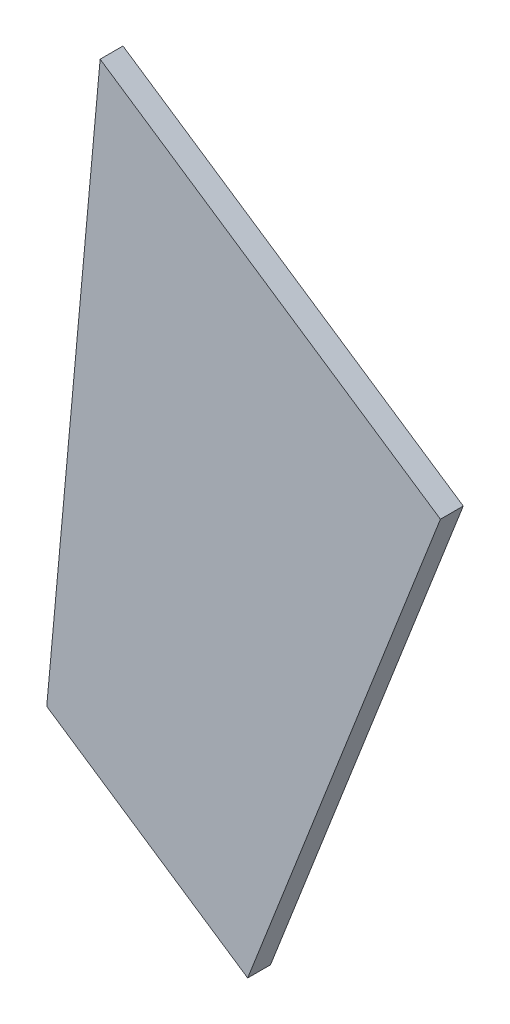
ISO-10303-21;
HEADER;
FILE_DESCRIPTION(('STEP AP214'),'2;1');
FILE_NAME('part.step','',(''),(''),'','','');
FILE_SCHEMA(('AUTOMOTIVE_DESIGN { 1 0 10303 214 1 1 1 1 }'));
ENDSEC;
DATA;
#1=APPLICATION_CONTEXT('core data for automotive mechanical design processes');
#2=APPLICATION_PROTOCOL_DEFINITION('international standard','automotive_design',2000,#1);
#3=PRODUCT_CONTEXT('',#1,'mechanical');
#4=PRODUCT('Part','Part','',(#3));
#5=PRODUCT_RELATED_PRODUCT_CATEGORY('part','',(#4));
#6=PRODUCT_DEFINITION_FORMATION('','',#4);
#7=PRODUCT_DEFINITION_CONTEXT('part definition',#1,'design');
#8=PRODUCT_DEFINITION('design','',#6,#7);
#9=PRODUCT_DEFINITION_SHAPE('','',#8);
#10=(LENGTH_UNIT() NAMED_UNIT(*) SI_UNIT(.MILLI.,.METRE.));
#11=(NAMED_UNIT(*) PLANE_ANGLE_UNIT() SI_UNIT($,.RADIAN.));
#12=(NAMED_UNIT(*) SI_UNIT($,.STERADIAN.) SOLID_ANGLE_UNIT());
#13=UNCERTAINTY_MEASURE_WITH_UNIT(LENGTH_MEASURE(1.E-05),#10,'distance_accuracy_value','');
#14=(GEOMETRIC_REPRESENTATION_CONTEXT(3) GLOBAL_UNCERTAINTY_ASSIGNED_CONTEXT((#13)) GLOBAL_UNIT_ASSIGNED_CONTEXT((#10,
#11,#12)) REPRESENTATION_CONTEXT('',''));
#15=CARTESIAN_POINT('',(0.,0.,0.));
#16=DIRECTION('',(0.,0.,1.));
#17=DIRECTION('',(1.,0.,0.));
#18=AXIS2_PLACEMENT_3D('',#15,#16,#17);
#19=CARTESIAN_POINT('',(-7.0187323550614,-77.1733943034063,3.));
#20=DIRECTION('',(0.557064857866016,0.83046899046907,0.));
#21=DIRECTION('',(-0.83046899046907,0.557064857866016,0.));
#22=AXIS2_PLACEMENT_3D('',#19,#20,#21);
#23=PLANE('',#22);
#24=DIRECTION('',(0.83046899046907,-0.557064857866015,0.));
#25=VECTOR('',#24,1.);
#26=CARTESIAN_POINT('',(-7.0187323550614,-77.1733943034063,0.));
#27=LINE('',#26,#25);
#28=CARTESIAN_POINT('',(-7.0187323550614,-77.1733943034063,0.));
#29=VERTEX_POINT('',#28);
#30=CARTESIAN_POINT('',(19.3894757651513,-94.8875833602106,0.));
#31=VERTEX_POINT('',#30);
#32=EDGE_CURVE('E96',#29,#31,#27,.T.);
#33=ORIENTED_EDGE('',*,*,#32,.T.);
#34=DIRECTION('',(0.,0.,-1.));
#35=VECTOR('',#34,1.);
#36=CARTESIAN_POINT('',(19.3894757651513,-94.8875833602106,3.));
#37=LINE('',#36,#35);
#38=CARTESIAN_POINT('',(19.3894757651513,-94.8875833602106,3.));
#39=VERTEX_POINT('',#38);
#40=EDGE_CURVE('E11',#39,#31,#37,.T.);
#41=ORIENTED_EDGE('',*,*,#40,.F.);
#42=DIRECTION('',(0.83046899046907,-0.557064857866015,0.));
#43=VECTOR('',#42,1.);
#44=CARTESIAN_POINT('',(-7.0187323550614,-77.1733943034063,3.));
#45=LINE('',#44,#43);
#46=CARTESIAN_POINT('',(-7.0187323550614,-77.1733943034063,3.));
#47=VERTEX_POINT('',#46);
#48=EDGE_CURVE('E84',#47,#39,#45,.T.);
#49=ORIENTED_EDGE('',*,*,#48,.F.);
#50=DIRECTION('',(0.,0.,-1.));
#51=VECTOR('',#50,1.);
#52=CARTESIAN_POINT('',(-7.0187323550614,-77.1733943034063,3.));
#53=LINE('',#52,#51);
#54=EDGE_CURVE('E92',#47,#29,#53,.T.);
#55=ORIENTED_EDGE('',*,*,#54,.T.);
#56=EDGE_LOOP('',(#33,#41,#49,#55));
#57=FACE_BOUND('',#56,.T.);
#58=ADVANCED_FACE('F33',(#57),#23,.F.);
#59=CARTESIAN_POINT('',(19.3894757651513,-94.8875833602106,3.));
#60=DIRECTION('',(-0.931517500449024,0.3636965030863,0.));
#61=DIRECTION('',(-0.3636965030863,-0.931517500449024,0.));
#62=AXIS2_PLACEMENT_3D('',#59,#60,#61);
#63=PLANE('',#62);
#64=DIRECTION('',(0.3636965030863,0.931517500449024,0.));
#65=VECTOR('',#64,1.);
#66=CARTESIAN_POINT('',(19.3894757651513,-94.8875833602106,0.));
#67=LINE('',#66,#65);
#68=CARTESIAN_POINT('',(44.7238223023361,-30.0000000000044,0.));
#69=VERTEX_POINT('',#68);
#70=EDGE_CURVE('E88',#31,#69,#67,.T.);
#71=ORIENTED_EDGE('',*,*,#70,.T.);
#72=DIRECTION('',(0.,0.,-1.));
#73=VECTOR('',#72,1.);
#74=CARTESIAN_POINT('',(44.7238223023361,-30.0000000000044,3.));
#75=LINE('',#74,#73);
#76=CARTESIAN_POINT('',(44.7238223023361,-30.0000000000044,3.));
#77=VERTEX_POINT('',#76);
#78=EDGE_CURVE('E41',#77,#69,#75,.T.);
#79=ORIENTED_EDGE('',*,*,#78,.F.);
#80=DIRECTION('',(0.3636965030863,0.931517500449024,0.));
#81=VECTOR('',#80,1.);
#82=CARTESIAN_POINT('',(19.3894757651513,-94.8875833602106,3.));
#83=LINE('',#82,#81);
#84=EDGE_CURVE('E79',#39,#77,#83,.T.);
#85=ORIENTED_EDGE('',*,*,#84,.F.);
#86=ORIENTED_EDGE('',*,*,#40,.T.);
#87=EDGE_LOOP('',(#71,#79,#85,#86));
#88=FACE_BOUND('',#87,.T.);
#89=ADVANCED_FACE('F87',(#88),#63,.F.);
#90=CARTESIAN_POINT('',(0.,0.,3.));
#91=DIRECTION('',(-0.557064857866015,-0.83046899046907,0.));
#92=DIRECTION('',(0.83046899046907,-0.557064857866015,0.));
#93=AXIS2_PLACEMENT_3D('',#90,#91,#92);
#94=PLANE('',#93);
#95=DIRECTION('',(-0.83046899046907,0.557064857866015,0.));
#96=VECTOR('',#95,1.);
#97=CARTESIAN_POINT('',(0.,0.,0.));
#98=LINE('',#97,#96);
#99=CARTESIAN_POINT('',(0.,0.,0.));
#100=VERTEX_POINT('',#99);
#101=EDGE_CURVE('E66',#69,#100,#98,.T.);
#102=ORIENTED_EDGE('',*,*,#101,.T.);
#103=DIRECTION('',(0.,0.,-1.));
#104=VECTOR('',#103,1.);
#105=CARTESIAN_POINT('',(0.,0.,3.));
#106=LINE('',#105,#104);
#107=CARTESIAN_POINT('',(0.,0.,3.));
#108=VERTEX_POINT('',#107);
#109=EDGE_CURVE('E89',#108,#100,#106,.T.);
#110=ORIENTED_EDGE('',*,*,#109,.F.);
#111=DIRECTION('',(-0.83046899046907,0.557064857866015,0.));
#112=VECTOR('',#111,1.);
#113=CARTESIAN_POINT('',(0.,0.,3.));
#114=LINE('',#113,#112);
#115=EDGE_CURVE('E82',#77,#108,#114,.T.);
#116=ORIENTED_EDGE('',*,*,#115,.F.);
#117=ORIENTED_EDGE('',*,*,#78,.T.);
#118=EDGE_LOOP('',(#102,#110,#116,#117));
#119=FACE_BOUND('',#118,.T.);
#120=ADVANCED_FACE('F90',(#119),#94,.F.);
#121=CARTESIAN_POINT('',(-7.0187323550614,-77.1733943034063,3.));
#122=DIRECTION('',(0.995889750955312,-0.0905737486370424,0.));
#123=DIRECTION('',(0.0905737486370424,0.995889750955312,0.));
#124=AXIS2_PLACEMENT_3D('',#121,#122,#123);
#125=PLANE('',#124);
#126=DIRECTION('',(-0.0905737486370424,-0.995889750955312,0.));
#127=VECTOR('',#126,1.);
#128=CARTESIAN_POINT('',(-7.0187323550614,-77.1733943034063,0.));
#129=LINE('',#128,#127);
#130=EDGE_CURVE('E72',#100,#29,#129,.T.);
#131=ORIENTED_EDGE('',*,*,#130,.T.);
#132=ORIENTED_EDGE('',*,*,#54,.F.);
#133=DIRECTION('',(-0.0905737486370424,-0.995889750955312,0.));
#134=VECTOR('',#133,1.);
#135=CARTESIAN_POINT('',(-7.0187323550614,-77.1733943034063,3.));
#136=LINE('',#135,#134);
#137=EDGE_CURVE('E49',#108,#47,#136,.T.);
#138=ORIENTED_EDGE('',*,*,#137,.F.);
#139=ORIENTED_EDGE('',*,*,#109,.T.);
#140=EDGE_LOOP('',(#131,#132,#138,#139));
#141=FACE_BOUND('',#140,.T.);
#142=ADVANCED_FACE('F103',(#141),#125,.F.);
#143=CARTESIAN_POINT('',(0.,0.,3.));
#144=DIRECTION('',(0.,0.,1.));
#145=DIRECTION('',(1.,0.,0.));
#146=AXIS2_PLACEMENT_3D('',#143,#144,#145);
#147=PLANE('',#146);
#148=ORIENTED_EDGE('',*,*,#48,.T.);
#149=ORIENTED_EDGE('',*,*,#84,.T.);
#150=ORIENTED_EDGE('',*,*,#115,.T.);
#151=ORIENTED_EDGE('',*,*,#137,.T.);
#152=EDGE_LOOP('',(#148,#149,#150,#151));
#153=FACE_BOUND('',#152,.T.);
#154=ADVANCED_FACE('F80',(#153),#147,.T.);
#155=CARTESIAN_POINT('',(0.,0.,0.));
#156=DIRECTION('',(0.,0.,1.));
#157=DIRECTION('',(1.,0.,0.));
#158=AXIS2_PLACEMENT_3D('',#155,#156,#157);
#159=PLANE('',#158);
#160=ORIENTED_EDGE('',*,*,#32,.F.);
#161=ORIENTED_EDGE('',*,*,#130,.F.);
#162=ORIENTED_EDGE('',*,*,#101,.F.);
#163=ORIENTED_EDGE('',*,*,#70,.F.);
#164=EDGE_LOOP('',(#160,#161,#162,#163));
#165=FACE_BOUND('',#164,.T.);
#166=ADVANCED_FACE('F106',(#165),#159,.F.);
#167=CLOSED_SHELL('',(#58,#89,#120,#142,#154,#166));
#168=MANIFOLD_SOLID_BREP('B2',#167);
#169=ADVANCED_BREP_SHAPE_REPRESENTATION('',(#18,#168),#14);
#170=SHAPE_DEFINITION_REPRESENTATION(#9,#169);
ENDSEC;
END-ISO-10303-21;
